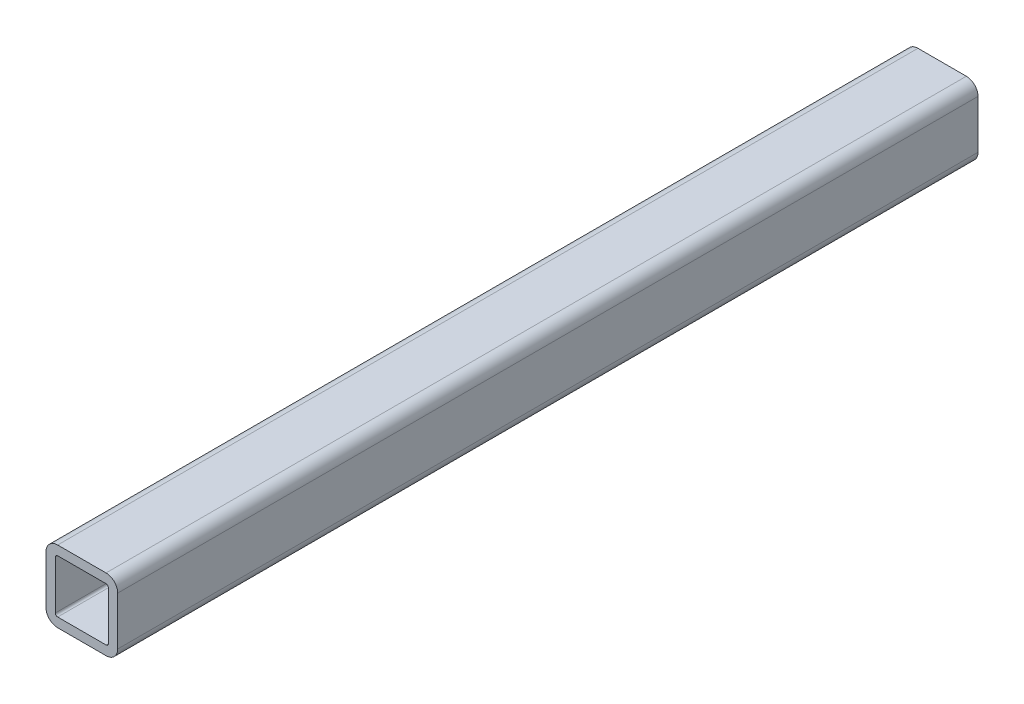
ISO-10303-21;
HEADER;
FILE_DESCRIPTION(('STEP AP214'),'2;1');
FILE_NAME('part.step','',(''),(''),'','','');
FILE_SCHEMA(('AUTOMOTIVE_DESIGN { 1 0 10303 214 1 1 1 1 }'));
ENDSEC;
DATA;
#1=APPLICATION_CONTEXT('core data for automotive mechanical design processes');
#2=APPLICATION_PROTOCOL_DEFINITION('international standard','automotive_design',2000,#1);
#3=PRODUCT_CONTEXT('',#1,'mechanical');
#4=PRODUCT('Part','Part','',(#3));
#5=PRODUCT_RELATED_PRODUCT_CATEGORY('part','',(#4));
#6=PRODUCT_DEFINITION_FORMATION('','',#4);
#7=PRODUCT_DEFINITION_CONTEXT('part definition',#1,'design');
#8=PRODUCT_DEFINITION('design','',#6,#7);
#9=PRODUCT_DEFINITION_SHAPE('','',#8);
#10=(LENGTH_UNIT() NAMED_UNIT(*) SI_UNIT(.MILLI.,.METRE.));
#11=(NAMED_UNIT(*) PLANE_ANGLE_UNIT() SI_UNIT($,.RADIAN.));
#12=(NAMED_UNIT(*) SI_UNIT($,.STERADIAN.) SOLID_ANGLE_UNIT());
#13=UNCERTAINTY_MEASURE_WITH_UNIT(LENGTH_MEASURE(1.E-05),#10,'distance_accuracy_value','');
#14=(GEOMETRIC_REPRESENTATION_CONTEXT(3) GLOBAL_UNCERTAINTY_ASSIGNED_CONTEXT((#13)) GLOBAL_UNIT_ASSIGNED_CONTEXT((#10,
#11,#12)) REPRESENTATION_CONTEXT('',''));
#15=CARTESIAN_POINT('',(0.,0.,0.));
#16=DIRECTION('',(0.,0.,1.));
#17=DIRECTION('',(1.,0.,0.));
#18=AXIS2_PLACEMENT_3D('',#15,#16,#17);
#19=CARTESIAN_POINT('',(4.28625000000001,-4.28625000000001,76.2));
#20=DIRECTION('',(0.,0.,1.));
#21=DIRECTION('',(1.,0.,0.));
#22=AXIS2_PLACEMENT_3D('',#19,#20,#21);
#23=PLANE('',#22);
#24=CARTESIAN_POINT('',(4.28625000000001,-4.28625000000001,76.2));
#25=DIRECTION('',(0.,0.,1.));
#26=DIRECTION('',(1.,0.,0.));
#27=AXIS2_PLACEMENT_3D('',#24,#25,#26);
#28=CIRCLE('',#27,2.06375);
#29=CARTESIAN_POINT('',(4.28625000000001,-6.35000000000001,76.2));
#30=VERTEX_POINT('',#29);
#31=CARTESIAN_POINT('',(6.35000000000001,-4.28625000000001,76.2));
#32=VERTEX_POINT('',#31);
#33=EDGE_CURVE('E247',#30,#32,#28,.T.);
#34=ORIENTED_EDGE('',*,*,#33,.T.);
#35=DIRECTION('',(0.,1.,0.));
#36=VECTOR('',#35,1.);
#37=CARTESIAN_POINT('',(6.35000000000001,-4.28625000000001,76.2));
#38=LINE('',#37,#36);
#39=CARTESIAN_POINT('',(6.35000000000001,4.28625000000001,76.2));
#40=VERTEX_POINT('',#39);
#41=EDGE_CURVE('E251',#32,#40,#38,.T.);
#42=ORIENTED_EDGE('',*,*,#41,.T.);
#43=CARTESIAN_POINT('',(4.28625000000001,4.28625000000001,76.2));
#44=DIRECTION('',(0.,0.,1.));
#45=DIRECTION('',(1.,0.,0.));
#46=AXIS2_PLACEMENT_3D('',#43,#44,#45);
#47=CIRCLE('',#46,2.06375);
#48=CARTESIAN_POINT('',(4.28625000000001,6.35000000000001,76.2));
#49=VERTEX_POINT('',#48);
#50=EDGE_CURVE('E255',#40,#49,#47,.T.);
#51=ORIENTED_EDGE('',*,*,#50,.T.);
#52=DIRECTION('',(-1.,0.,0.));
#53=VECTOR('',#52,1.);
#54=CARTESIAN_POINT('',(4.28625000000001,6.35000000000001,76.2));
#55=LINE('',#54,#53);
#56=CARTESIAN_POINT('',(-4.28625000000001,6.35000000000001,76.2));
#57=VERTEX_POINT('',#56);
#58=EDGE_CURVE('E258',#49,#57,#55,.T.);
#59=ORIENTED_EDGE('',*,*,#58,.T.);
#60=CARTESIAN_POINT('',(-4.28625000000001,4.28625000000001,76.2));
#61=DIRECTION('',(0.,0.,1.));
#62=DIRECTION('',(1.,0.,0.));
#63=AXIS2_PLACEMENT_3D('',#60,#61,#62);
#64=CIRCLE('',#63,2.06375);
#65=CARTESIAN_POINT('',(-6.35000000000001,4.28625000000001,76.2));
#66=VERTEX_POINT('',#65);
#67=EDGE_CURVE('E261',#57,#66,#64,.T.);
#68=ORIENTED_EDGE('',*,*,#67,.T.);
#69=DIRECTION('',(0.,-1.,0.));
#70=VECTOR('',#69,1.);
#71=CARTESIAN_POINT('',(-6.35000000000001,-4.28625000000001,76.2));
#72=LINE('',#71,#70);
#73=CARTESIAN_POINT('',(-6.35000000000001,-4.28625000000001,76.2));
#74=VERTEX_POINT('',#73);
#75=EDGE_CURVE('E264',#66,#74,#72,.T.);
#76=ORIENTED_EDGE('',*,*,#75,.T.);
#77=CARTESIAN_POINT('',(-4.28625000000001,-4.28625000000001,76.2));
#78=DIRECTION('',(0.,0.,1.));
#79=DIRECTION('',(1.,0.,0.));
#80=AXIS2_PLACEMENT_3D('',#77,#78,#79);
#81=CIRCLE('',#80,2.06375);
#82=CARTESIAN_POINT('',(-4.28625000000001,-6.35000000000001,76.2));
#83=VERTEX_POINT('',#82);
#84=EDGE_CURVE('E267',#74,#83,#81,.T.);
#85=ORIENTED_EDGE('',*,*,#84,.T.);
#86=DIRECTION('',(1.,0.,0.));
#87=VECTOR('',#86,1.);
#88=CARTESIAN_POINT('',(4.28625000000001,-6.35000000000001,76.2));
#89=LINE('',#88,#87);
#90=EDGE_CURVE('E270',#83,#30,#89,.T.);
#91=ORIENTED_EDGE('',*,*,#90,.T.);
#92=EDGE_LOOP('',(#34,#42,#51,#59,#68,#76,#85,#91));
#93=FACE_BOUND('',#92,.T.);
#94=DIRECTION('',(-1.,0.,0.));
#95=VECTOR('',#94,1.);
#96=CARTESIAN_POINT('',(4.28625000000001,4.69900000000001,76.2));
#97=LINE('',#96,#95);
#98=CARTESIAN_POINT('',(4.28625000000001,4.69900000000001,76.2));
#99=VERTEX_POINT('',#98);
#100=CARTESIAN_POINT('',(-4.28625000000001,4.69900000000001,76.2));
#101=VERTEX_POINT('',#100);
#102=EDGE_CURVE('E167',#99,#101,#97,.T.);
#103=ORIENTED_EDGE('',*,*,#102,.F.);
#104=CARTESIAN_POINT('',(4.28625000000001,4.28625000000001,76.2));
#105=DIRECTION('',(0.,0.,1.));
#106=DIRECTION('',(1.,0.,0.));
#107=AXIS2_PLACEMENT_3D('',#104,#105,#106);
#108=CIRCLE('',#107,0.412750000000003);
#109=CARTESIAN_POINT('',(4.69900000000001,4.28625000000001,76.2));
#110=VERTEX_POINT('',#109);
#111=EDGE_CURVE('E158',#110,#99,#108,.T.);
#112=ORIENTED_EDGE('',*,*,#111,.F.);
#113=DIRECTION('',(0.,1.,0.));
#114=VECTOR('',#113,1.);
#115=CARTESIAN_POINT('',(4.69900000000001,4.28625000000001,76.2));
#116=LINE('',#115,#114);
#117=CARTESIAN_POINT('',(4.69900000000001,-4.28625000000001,76.2));
#118=VERTEX_POINT('',#117);
#119=EDGE_CURVE('E199',#118,#110,#116,.T.);
#120=ORIENTED_EDGE('',*,*,#119,.F.);
#121=CARTESIAN_POINT('',(4.28625000000001,-4.28625000000001,76.2));
#122=DIRECTION('',(0.,0.,1.));
#123=DIRECTION('',(1.,0.,0.));
#124=AXIS2_PLACEMENT_3D('',#121,#122,#123);
#125=CIRCLE('',#124,0.412750000000003);
#126=CARTESIAN_POINT('',(4.28625000000001,-4.69900000000001,76.2));
#127=VERTEX_POINT('',#126);
#128=EDGE_CURVE('E196',#127,#118,#125,.T.);
#129=ORIENTED_EDGE('',*,*,#128,.F.);
#130=DIRECTION('',(1.,0.,0.));
#131=VECTOR('',#130,1.);
#132=CARTESIAN_POINT('',(4.28625000000001,-4.69900000000001,76.2));
#133=LINE('',#132,#131);
#134=CARTESIAN_POINT('',(-4.28625000000001,-4.69900000000001,76.2));
#135=VERTEX_POINT('',#134);
#136=EDGE_CURVE('E193',#135,#127,#133,.T.);
#137=ORIENTED_EDGE('',*,*,#136,.F.);
#138=CARTESIAN_POINT('',(-4.28625000000001,-4.28625000000001,76.2));
#139=DIRECTION('',(0.,0.,1.));
#140=DIRECTION('',(1.,0.,0.));
#141=AXIS2_PLACEMENT_3D('',#138,#139,#140);
#142=CIRCLE('',#141,0.412750000000003);
#143=CARTESIAN_POINT('',(-4.69900000000001,-4.28625000000001,76.2));
#144=VERTEX_POINT('',#143);
#145=EDGE_CURVE('E190',#144,#135,#142,.T.);
#146=ORIENTED_EDGE('',*,*,#145,.F.);
#147=DIRECTION('',(0.,-1.,0.));
#148=VECTOR('',#147,1.);
#149=CARTESIAN_POINT('',(-4.69900000000001,4.28625000000001,76.2));
#150=LINE('',#149,#148);
#151=CARTESIAN_POINT('',(-4.69900000000001,4.28625000000001,76.2));
#152=VERTEX_POINT('',#151);
#153=EDGE_CURVE('E185',#152,#144,#150,.T.);
#154=ORIENTED_EDGE('',*,*,#153,.F.);
#155=CARTESIAN_POINT('',(-4.28625000000001,4.28625000000001,76.2));
#156=DIRECTION('',(0.,0.,1.));
#157=DIRECTION('',(1.,0.,0.));
#158=AXIS2_PLACEMENT_3D('',#155,#156,#157);
#159=CIRCLE('',#158,0.412750000000003);
#160=EDGE_CURVE('E181',#101,#152,#159,.T.);
#161=ORIENTED_EDGE('',*,*,#160,.F.);
#162=EDGE_LOOP('',(#103,#112,#120,#129,#137,#146,#154,#161));
#163=FACE_BOUND('',#162,.T.);
#164=ADVANCED_FACE('F44',(#93,#163),#23,.T.);
#165=CARTESIAN_POINT('',(4.28625000000001,-4.28625000000001,-76.2));
#166=DIRECTION('',(0.,0.,1.));
#167=DIRECTION('',(1.,0.,0.));
#168=AXIS2_PLACEMENT_3D('',#165,#166,#167);
#169=PLANE('',#168);
#170=CARTESIAN_POINT('',(4.28625000000001,-4.28625000000001,-76.2));
#171=DIRECTION('',(0.,0.,1.));
#172=DIRECTION('',(1.,0.,0.));
#173=AXIS2_PLACEMENT_3D('',#170,#171,#172);
#174=CIRCLE('',#173,2.06375);
#175=CARTESIAN_POINT('',(4.28625000000001,-6.35000000000001,-76.2));
#176=VERTEX_POINT('',#175);
#177=CARTESIAN_POINT('',(6.35000000000001,-4.28625000000001,-76.2));
#178=VERTEX_POINT('',#177);
#179=EDGE_CURVE('E176',#176,#178,#174,.T.);
#180=ORIENTED_EDGE('',*,*,#179,.F.);
#181=DIRECTION('',(1.,0.,0.));
#182=VECTOR('',#181,1.);
#183=CARTESIAN_POINT('',(4.28625000000001,-6.35000000000001,-76.2));
#184=LINE('',#183,#182);
#185=CARTESIAN_POINT('',(-4.28625000000001,-6.35000000000001,-76.2));
#186=VERTEX_POINT('',#185);
#187=EDGE_CURVE('E252',#186,#176,#184,.T.);
#188=ORIENTED_EDGE('',*,*,#187,.F.);
#189=CARTESIAN_POINT('',(-4.28625000000001,-4.28625000000001,-76.2));
#190=DIRECTION('',(0.,0.,1.));
#191=DIRECTION('',(1.,0.,0.));
#192=AXIS2_PLACEMENT_3D('',#189,#190,#191);
#193=CIRCLE('',#192,2.06375);
#194=CARTESIAN_POINT('',(-6.35000000000001,-4.28625000000001,-76.2));
#195=VERTEX_POINT('',#194);
#196=EDGE_CURVE('E292',#195,#186,#193,.T.);
#197=ORIENTED_EDGE('',*,*,#196,.F.);
#198=DIRECTION('',(0.,-1.,0.));
#199=VECTOR('',#198,1.);
#200=CARTESIAN_POINT('',(-6.35000000000001,-4.28625000000001,-76.2));
#201=LINE('',#200,#199);
#202=CARTESIAN_POINT('',(-6.35000000000001,4.28625000000001,-76.2));
#203=VERTEX_POINT('',#202);
#204=EDGE_CURVE('E289',#203,#195,#201,.T.);
#205=ORIENTED_EDGE('',*,*,#204,.F.);
#206=CARTESIAN_POINT('',(-4.28625000000001,4.28625000000001,-76.2));
#207=DIRECTION('',(0.,0.,1.));
#208=DIRECTION('',(1.,0.,0.));
#209=AXIS2_PLACEMENT_3D('',#206,#207,#208);
#210=CIRCLE('',#209,2.06375);
#211=CARTESIAN_POINT('',(-4.28625000000001,6.35000000000001,-76.2));
#212=VERTEX_POINT('',#211);
#213=EDGE_CURVE('E286',#212,#203,#210,.T.);
#214=ORIENTED_EDGE('',*,*,#213,.F.);
#215=DIRECTION('',(-1.,0.,0.));
#216=VECTOR('',#215,1.);
#217=CARTESIAN_POINT('',(4.28625000000001,6.35000000000001,-76.2));
#218=LINE('',#217,#216);
#219=CARTESIAN_POINT('',(4.28625000000001,6.35000000000001,-76.2));
#220=VERTEX_POINT('',#219);
#221=EDGE_CURVE('E283',#220,#212,#218,.T.);
#222=ORIENTED_EDGE('',*,*,#221,.F.);
#223=CARTESIAN_POINT('',(4.28625000000001,4.28625000000001,-76.2));
#224=DIRECTION('',(0.,0.,1.));
#225=DIRECTION('',(1.,0.,0.));
#226=AXIS2_PLACEMENT_3D('',#223,#224,#225);
#227=CIRCLE('',#226,2.06375);
#228=CARTESIAN_POINT('',(6.35000000000001,4.28625000000001,-76.2));
#229=VERTEX_POINT('',#228);
#230=EDGE_CURVE('E280',#229,#220,#227,.T.);
#231=ORIENTED_EDGE('',*,*,#230,.F.);
#232=DIRECTION('',(0.,1.,0.));
#233=VECTOR('',#232,1.);
#234=CARTESIAN_POINT('',(6.35000000000001,-4.28625000000001,-76.2));
#235=LINE('',#234,#233);
#236=EDGE_CURVE('E277',#178,#229,#235,.T.);
#237=ORIENTED_EDGE('',*,*,#236,.F.);
#238=EDGE_LOOP('',(#180,#188,#197,#205,#214,#222,#231,#237));
#239=FACE_BOUND('',#238,.T.);
#240=CARTESIAN_POINT('',(4.28625000000001,4.28625000000001,-76.2));
#241=DIRECTION('',(0.,0.,1.));
#242=DIRECTION('',(1.,0.,0.));
#243=AXIS2_PLACEMENT_3D('',#240,#241,#242);
#244=CIRCLE('',#243,0.412750000000003);
#245=CARTESIAN_POINT('',(4.69900000000001,4.28625000000001,-76.2));
#246=VERTEX_POINT('',#245);
#247=CARTESIAN_POINT('',(4.28625000000001,4.69900000000001,-76.2));
#248=VERTEX_POINT('',#247);
#249=EDGE_CURVE('E68',#246,#248,#244,.T.);
#250=ORIENTED_EDGE('',*,*,#249,.T.);
#251=DIRECTION('',(-1.,0.,0.));
#252=VECTOR('',#251,1.);
#253=CARTESIAN_POINT('',(4.28625000000001,4.69900000000001,-76.2));
#254=LINE('',#253,#252);
#255=CARTESIAN_POINT('',(-4.28625000000001,4.69900000000001,-76.2));
#256=VERTEX_POINT('',#255);
#257=EDGE_CURVE('E174',#248,#256,#254,.T.);
#258=ORIENTED_EDGE('',*,*,#257,.T.);
#259=CARTESIAN_POINT('',(-4.28625000000001,4.28625000000001,-76.2));
#260=DIRECTION('',(0.,0.,1.));
#261=DIRECTION('',(1.,0.,0.));
#262=AXIS2_PLACEMENT_3D('',#259,#260,#261);
#263=CIRCLE('',#262,0.412750000000003);
#264=CARTESIAN_POINT('',(-4.69900000000001,4.28625000000001,-76.2));
#265=VERTEX_POINT('',#264);
#266=EDGE_CURVE('E206',#256,#265,#263,.T.);
#267=ORIENTED_EDGE('',*,*,#266,.T.);
#268=DIRECTION('',(0.,-1.,0.));
#269=VECTOR('',#268,1.);
#270=CARTESIAN_POINT('',(-4.69900000000001,4.28625000000001,-76.2));
#271=LINE('',#270,#269);
#272=CARTESIAN_POINT('',(-4.69900000000001,-4.28625000000001,-76.2));
#273=VERTEX_POINT('',#272);
#274=EDGE_CURVE('E210',#265,#273,#271,.T.);
#275=ORIENTED_EDGE('',*,*,#274,.T.);
#276=CARTESIAN_POINT('',(-4.28625000000001,-4.28625000000001,-76.2));
#277=DIRECTION('',(0.,0.,1.));
#278=DIRECTION('',(1.,0.,0.));
#279=AXIS2_PLACEMENT_3D('',#276,#277,#278);
#280=CIRCLE('',#279,0.412750000000003);
#281=CARTESIAN_POINT('',(-4.28625000000001,-4.69900000000001,-76.2));
#282=VERTEX_POINT('',#281);
#283=EDGE_CURVE('E214',#273,#282,#280,.T.);
#284=ORIENTED_EDGE('',*,*,#283,.T.);
#285=DIRECTION('',(1.,0.,0.));
#286=VECTOR('',#285,1.);
#287=CARTESIAN_POINT('',(4.28625000000001,-4.69900000000001,-76.2));
#288=LINE('',#287,#286);
#289=CARTESIAN_POINT('',(4.28625000000001,-4.69900000000001,-76.2));
#290=VERTEX_POINT('',#289);
#291=EDGE_CURVE('E218',#282,#290,#288,.T.);
#292=ORIENTED_EDGE('',*,*,#291,.T.);
#293=CARTESIAN_POINT('',(4.28625000000001,-4.28625000000001,-76.2));
#294=DIRECTION('',(0.,0.,1.));
#295=DIRECTION('',(1.,0.,0.));
#296=AXIS2_PLACEMENT_3D('',#293,#294,#295);
#297=CIRCLE('',#296,0.412750000000003);
#298=CARTESIAN_POINT('',(4.69900000000001,-4.28625000000001,-76.2));
#299=VERTEX_POINT('',#298);
#300=EDGE_CURVE('E222',#290,#299,#297,.T.);
#301=ORIENTED_EDGE('',*,*,#300,.T.);
#302=DIRECTION('',(0.,1.,0.));
#303=VECTOR('',#302,1.);
#304=CARTESIAN_POINT('',(4.69900000000001,4.28625000000001,-76.2));
#305=LINE('',#304,#303);
#306=EDGE_CURVE('E168',#299,#246,#305,.T.);
#307=ORIENTED_EDGE('',*,*,#306,.T.);
#308=EDGE_LOOP('',(#250,#258,#267,#275,#284,#292,#301,#307));
#309=FACE_BOUND('',#308,.T.);
#310=ADVANCED_FACE('F331',(#239,#309),#169,.F.);
#311=CARTESIAN_POINT('',(4.28625000000001,-4.28625000000001,76.2));
#312=DIRECTION('',(0.,0.,-1.));
#313=DIRECTION('',(-1.,0.,0.));
#314=AXIS2_PLACEMENT_3D('',#311,#312,#313);
#315=CYLINDRICAL_SURFACE('',#314,2.06375);
#316=ORIENTED_EDGE('',*,*,#179,.T.);
#317=DIRECTION('',(0.,0.,-1.));
#318=VECTOR('',#317,1.);
#319=CARTESIAN_POINT('',(6.35000000000001,-4.28625000000001,76.2));
#320=LINE('',#319,#318);
#321=EDGE_CURVE('E11',#32,#178,#320,.T.);
#322=ORIENTED_EDGE('',*,*,#321,.F.);
#323=ORIENTED_EDGE('',*,*,#33,.F.);
#324=DIRECTION('',(0.,0.,-1.));
#325=VECTOR('',#324,1.);
#326=CARTESIAN_POINT('',(4.28625000000001,-6.35000000000001,76.2));
#327=LINE('',#326,#325);
#328=EDGE_CURVE('E273',#30,#176,#327,.T.);
#329=ORIENTED_EDGE('',*,*,#328,.T.);
#330=EDGE_LOOP('',(#316,#322,#323,#329));
#331=FACE_BOUND('',#330,.T.);
#332=ADVANCED_FACE('F46',(#331),#315,.T.);
#333=CARTESIAN_POINT('',(6.35000000000001,-4.28625000000001,76.2));
#334=DIRECTION('',(-1.,0.,0.));
#335=DIRECTION('',(0.,0.,1.));
#336=AXIS2_PLACEMENT_3D('',#333,#334,#335);
#337=PLANE('',#336);
#338=ORIENTED_EDGE('',*,*,#236,.T.);
#339=DIRECTION('',(0.,0.,-1.));
#340=VECTOR('',#339,1.);
#341=CARTESIAN_POINT('',(6.35000000000001,4.28625000000001,76.2));
#342=LINE('',#341,#340);
#343=EDGE_CURVE('E53',#40,#229,#342,.T.);
#344=ORIENTED_EDGE('',*,*,#343,.F.);
#345=ORIENTED_EDGE('',*,*,#41,.F.);
#346=ORIENTED_EDGE('',*,*,#321,.T.);
#347=EDGE_LOOP('',(#338,#344,#345,#346));
#348=FACE_BOUND('',#347,.T.);
#349=ADVANCED_FACE('F348',(#348),#337,.F.);
#350=CARTESIAN_POINT('',(4.28625000000001,4.28625000000001,76.2));
#351=DIRECTION('',(0.,0.,-1.));
#352=DIRECTION('',(-1.,0.,0.));
#353=AXIS2_PLACEMENT_3D('',#350,#351,#352);
#354=CYLINDRICAL_SURFACE('',#353,2.06375);
#355=ORIENTED_EDGE('',*,*,#230,.T.);
#356=DIRECTION('',(0.,0.,-1.));
#357=VECTOR('',#356,1.);
#358=CARTESIAN_POINT('',(4.28625000000001,6.35000000000001,76.2));
#359=LINE('',#358,#357);
#360=EDGE_CURVE('E316',#49,#220,#359,.T.);
#361=ORIENTED_EDGE('',*,*,#360,.F.);
#362=ORIENTED_EDGE('',*,*,#50,.F.);
#363=ORIENTED_EDGE('',*,*,#343,.T.);
#364=EDGE_LOOP('',(#355,#361,#362,#363));
#365=FACE_BOUND('',#364,.T.);
#366=ADVANCED_FACE('F325',(#365),#354,.T.);
#367=CARTESIAN_POINT('',(4.28625000000001,6.35000000000001,76.2));
#368=DIRECTION('',(0.,-1.,0.));
#369=DIRECTION('',(0.,0.,-1.));
#370=AXIS2_PLACEMENT_3D('',#367,#368,#369);
#371=PLANE('',#370);
#372=ORIENTED_EDGE('',*,*,#221,.T.);
#373=DIRECTION('',(0.,0.,-1.));
#374=VECTOR('',#373,1.);
#375=CARTESIAN_POINT('',(-4.28625000000001,6.35000000000001,76.2));
#376=LINE('',#375,#374);
#377=EDGE_CURVE('E312',#57,#212,#376,.T.);
#378=ORIENTED_EDGE('',*,*,#377,.F.);
#379=ORIENTED_EDGE('',*,*,#58,.F.);
#380=ORIENTED_EDGE('',*,*,#360,.T.);
#381=EDGE_LOOP('',(#372,#378,#379,#380));
#382=FACE_BOUND('',#381,.T.);
#383=ADVANCED_FACE('F337',(#382),#371,.F.);
#384=CARTESIAN_POINT('',(-4.28625000000001,4.28625000000001,76.2));
#385=DIRECTION('',(0.,0.,-1.));
#386=DIRECTION('',(-1.,0.,0.));
#387=AXIS2_PLACEMENT_3D('',#384,#385,#386);
#388=CYLINDRICAL_SURFACE('',#387,2.06375);
#389=ORIENTED_EDGE('',*,*,#213,.T.);
#390=DIRECTION('',(0.,0.,-1.));
#391=VECTOR('',#390,1.);
#392=CARTESIAN_POINT('',(-6.35000000000001,4.28625000000001,76.2));
#393=LINE('',#392,#391);
#394=EDGE_CURVE('E308',#66,#203,#393,.T.);
#395=ORIENTED_EDGE('',*,*,#394,.F.);
#396=ORIENTED_EDGE('',*,*,#67,.F.);
#397=ORIENTED_EDGE('',*,*,#377,.T.);
#398=EDGE_LOOP('',(#389,#395,#396,#397));
#399=FACE_BOUND('',#398,.T.);
#400=ADVANCED_FACE('F341',(#399),#388,.T.);
#401=CARTESIAN_POINT('',(-6.35000000000001,-4.28625000000001,76.2));
#402=DIRECTION('',(1.,0.,0.));
#403=DIRECTION('',(0.,0.,-1.));
#404=AXIS2_PLACEMENT_3D('',#401,#402,#403);
#405=PLANE('',#404);
#406=ORIENTED_EDGE('',*,*,#204,.T.);
#407=DIRECTION('',(0.,0.,-1.));
#408=VECTOR('',#407,1.);
#409=CARTESIAN_POINT('',(-6.35000000000001,-4.28625000000001,76.2));
#410=LINE('',#409,#408);
#411=EDGE_CURVE('E304',#74,#195,#410,.T.);
#412=ORIENTED_EDGE('',*,*,#411,.F.);
#413=ORIENTED_EDGE('',*,*,#75,.F.);
#414=ORIENTED_EDGE('',*,*,#394,.T.);
#415=EDGE_LOOP('',(#406,#412,#413,#414));
#416=FACE_BOUND('',#415,.T.);
#417=ADVANCED_FACE('F361',(#416),#405,.F.);
#418=CARTESIAN_POINT('',(-4.28625000000001,-4.28625000000001,76.2));
#419=DIRECTION('',(0.,0.,-1.));
#420=DIRECTION('',(-1.,0.,0.));
#421=AXIS2_PLACEMENT_3D('',#418,#419,#420);
#422=CYLINDRICAL_SURFACE('',#421,2.06375);
#423=ORIENTED_EDGE('',*,*,#196,.T.);
#424=DIRECTION('',(0.,0.,-1.));
#425=VECTOR('',#424,1.);
#426=CARTESIAN_POINT('',(-4.28625000000001,-6.35000000000001,76.2));
#427=LINE('',#426,#425);
#428=EDGE_CURVE('E300',#83,#186,#427,.T.);
#429=ORIENTED_EDGE('',*,*,#428,.F.);
#430=ORIENTED_EDGE('',*,*,#84,.F.);
#431=ORIENTED_EDGE('',*,*,#411,.T.);
#432=EDGE_LOOP('',(#423,#429,#430,#431));
#433=FACE_BOUND('',#432,.T.);
#434=ADVANCED_FACE('F359',(#433),#422,.T.);
#435=CARTESIAN_POINT('',(4.28625000000001,-6.35000000000001,76.2));
#436=DIRECTION('',(0.,1.,0.));
#437=DIRECTION('',(0.,0.,1.));
#438=AXIS2_PLACEMENT_3D('',#435,#436,#437);
#439=PLANE('',#438);
#440=ORIENTED_EDGE('',*,*,#187,.T.);
#441=ORIENTED_EDGE('',*,*,#328,.F.);
#442=ORIENTED_EDGE('',*,*,#90,.F.);
#443=ORIENTED_EDGE('',*,*,#428,.T.);
#444=EDGE_LOOP('',(#440,#441,#442,#443));
#445=FACE_BOUND('',#444,.T.);
#446=ADVANCED_FACE('F354',(#445),#439,.F.);
#447=CARTESIAN_POINT('',(4.28625000000001,4.28625000000001,76.2));
#448=DIRECTION('',(0.,0.,-1.));
#449=DIRECTION('',(-1.,0.,0.));
#450=AXIS2_PLACEMENT_3D('',#447,#448,#449);
#451=CYLINDRICAL_SURFACE('',#450,0.412750000000003);
#452=ORIENTED_EDGE('',*,*,#249,.F.);
#453=DIRECTION('',(0.,0.,-1.));
#454=VECTOR('',#453,1.);
#455=CARTESIAN_POINT('',(4.69900000000001,4.28625000000001,76.2));
#456=LINE('',#455,#454);
#457=EDGE_CURVE('E162',#110,#246,#456,.T.);
#458=ORIENTED_EDGE('',*,*,#457,.F.);
#459=ORIENTED_EDGE('',*,*,#111,.T.);
#460=DIRECTION('',(0.,0.,-1.));
#461=VECTOR('',#460,1.);
#462=CARTESIAN_POINT('',(4.28625000000001,4.69900000000001,76.2));
#463=LINE('',#462,#461);
#464=EDGE_CURVE('E161',#99,#248,#463,.T.);
#465=ORIENTED_EDGE('',*,*,#464,.T.);
#466=EDGE_LOOP('',(#452,#458,#459,#465));
#467=FACE_BOUND('',#466,.T.);
#468=ADVANCED_FACE('F160',(#467),#451,.F.);
#469=CARTESIAN_POINT('',(4.28625000000001,4.69900000000001,76.2));
#470=DIRECTION('',(0.,-1.,0.));
#471=DIRECTION('',(0.,0.,-1.));
#472=AXIS2_PLACEMENT_3D('',#469,#470,#471);
#473=PLANE('',#472);
#474=ORIENTED_EDGE('',*,*,#257,.F.);
#475=ORIENTED_EDGE('',*,*,#464,.F.);
#476=ORIENTED_EDGE('',*,*,#102,.T.);
#477=DIRECTION('',(0.,0.,-1.));
#478=VECTOR('',#477,1.);
#479=CARTESIAN_POINT('',(-4.28625000000001,4.69900000000001,76.2));
#480=LINE('',#479,#478);
#481=EDGE_CURVE('E177',#101,#256,#480,.T.);
#482=ORIENTED_EDGE('',*,*,#481,.T.);
#483=EDGE_LOOP('',(#474,#475,#476,#482));
#484=FACE_BOUND('',#483,.T.);
#485=ADVANCED_FACE('F171',(#484),#473,.T.);
#486=CARTESIAN_POINT('',(-4.28625000000001,4.28625000000001,76.2));
#487=DIRECTION('',(0.,0.,-1.));
#488=DIRECTION('',(-1.,0.,0.));
#489=AXIS2_PLACEMENT_3D('',#486,#487,#488);
#490=CYLINDRICAL_SURFACE('',#489,0.412750000000003);
#491=ORIENTED_EDGE('',*,*,#266,.F.);
#492=ORIENTED_EDGE('',*,*,#481,.F.);
#493=ORIENTED_EDGE('',*,*,#160,.T.);
#494=DIRECTION('',(0.,0.,-1.));
#495=VECTOR('',#494,1.);
#496=CARTESIAN_POINT('',(-4.69900000000001,4.28625000000001,76.2));
#497=LINE('',#496,#495);
#498=EDGE_CURVE('E242',#152,#265,#497,.T.);
#499=ORIENTED_EDGE('',*,*,#498,.T.);
#500=EDGE_LOOP('',(#491,#492,#493,#499));
#501=FACE_BOUND('',#500,.T.);
#502=ADVANCED_FACE('F386',(#501),#490,.F.);
#503=CARTESIAN_POINT('',(-4.69900000000001,4.28625000000001,76.2));
#504=DIRECTION('',(1.,0.,0.));
#505=DIRECTION('',(0.,0.,-1.));
#506=AXIS2_PLACEMENT_3D('',#503,#504,#505);
#507=PLANE('',#506);
#508=ORIENTED_EDGE('',*,*,#274,.F.);
#509=ORIENTED_EDGE('',*,*,#498,.F.);
#510=ORIENTED_EDGE('',*,*,#153,.T.);
#511=DIRECTION('',(0.,0.,-1.));
#512=VECTOR('',#511,1.);
#513=CARTESIAN_POINT('',(-4.69900000000001,-4.28625000000001,76.2));
#514=LINE('',#513,#512);
#515=EDGE_CURVE('E239',#144,#273,#514,.T.);
#516=ORIENTED_EDGE('',*,*,#515,.T.);
#517=EDGE_LOOP('',(#508,#509,#510,#516));
#518=FACE_BOUND('',#517,.T.);
#519=ADVANCED_FACE('F390',(#518),#507,.T.);
#520=CARTESIAN_POINT('',(-4.28625000000001,-4.28625000000001,76.2));
#521=DIRECTION('',(0.,0.,-1.));
#522=DIRECTION('',(-1.,0.,0.));
#523=AXIS2_PLACEMENT_3D('',#520,#521,#522);
#524=CYLINDRICAL_SURFACE('',#523,0.412750000000003);
#525=ORIENTED_EDGE('',*,*,#283,.F.);
#526=ORIENTED_EDGE('',*,*,#515,.F.);
#527=ORIENTED_EDGE('',*,*,#145,.T.);
#528=DIRECTION('',(0.,0.,-1.));
#529=VECTOR('',#528,1.);
#530=CARTESIAN_POINT('',(-4.28625000000001,-4.69900000000001,76.2));
#531=LINE('',#530,#529);
#532=EDGE_CURVE('E236',#135,#282,#531,.T.);
#533=ORIENTED_EDGE('',*,*,#532,.T.);
#534=EDGE_LOOP('',(#525,#526,#527,#533));
#535=FACE_BOUND('',#534,.T.);
#536=ADVANCED_FACE('F396',(#535),#524,.F.);
#537=CARTESIAN_POINT('',(4.28625000000001,-4.69900000000001,76.2));
#538=DIRECTION('',(0.,1.,0.));
#539=DIRECTION('',(0.,0.,1.));
#540=AXIS2_PLACEMENT_3D('',#537,#538,#539);
#541=PLANE('',#540);
#542=ORIENTED_EDGE('',*,*,#291,.F.);
#543=ORIENTED_EDGE('',*,*,#532,.F.);
#544=ORIENTED_EDGE('',*,*,#136,.T.);
#545=DIRECTION('',(0.,0.,-1.));
#546=VECTOR('',#545,1.);
#547=CARTESIAN_POINT('',(4.28625000000001,-4.69900000000001,76.2));
#548=LINE('',#547,#546);
#549=EDGE_CURVE('E233',#127,#290,#548,.T.);
#550=ORIENTED_EDGE('',*,*,#549,.T.);
#551=EDGE_LOOP('',(#542,#543,#544,#550));
#552=FACE_BOUND('',#551,.T.);
#553=ADVANCED_FACE('F400',(#552),#541,.T.);
#554=CARTESIAN_POINT('',(4.28625000000001,-4.28625000000001,76.2));
#555=DIRECTION('',(0.,0.,-1.));
#556=DIRECTION('',(-1.,0.,0.));
#557=AXIS2_PLACEMENT_3D('',#554,#555,#556);
#558=CYLINDRICAL_SURFACE('',#557,0.412750000000003);
#559=ORIENTED_EDGE('',*,*,#300,.F.);
#560=ORIENTED_EDGE('',*,*,#549,.F.);
#561=ORIENTED_EDGE('',*,*,#128,.T.);
#562=DIRECTION('',(0.,0.,-1.));
#563=VECTOR('',#562,1.);
#564=CARTESIAN_POINT('',(4.69900000000001,-4.28625000000001,76.2));
#565=LINE('',#564,#563);
#566=EDGE_CURVE('E60',#118,#299,#565,.T.);
#567=ORIENTED_EDGE('',*,*,#566,.T.);
#568=EDGE_LOOP('',(#559,#560,#561,#567));
#569=FACE_BOUND('',#568,.T.);
#570=ADVANCED_FACE('F404',(#569),#558,.F.);
#571=CARTESIAN_POINT('',(4.69900000000001,4.28625000000001,76.2));
#572=DIRECTION('',(-1.,0.,0.));
#573=DIRECTION('',(0.,0.,1.));
#574=AXIS2_PLACEMENT_3D('',#571,#572,#573);
#575=PLANE('',#574);
#576=ORIENTED_EDGE('',*,*,#306,.F.);
#577=ORIENTED_EDGE('',*,*,#566,.F.);
#578=ORIENTED_EDGE('',*,*,#119,.T.);
#579=ORIENTED_EDGE('',*,*,#457,.T.);
#580=EDGE_LOOP('',(#576,#577,#578,#579));
#581=FACE_BOUND('',#580,.T.);
#582=ADVANCED_FACE('F408',(#581),#575,.T.);
#583=CLOSED_SHELL('',(#164,#310,#332,#349,#366,#383,#400,#417,#434,#446,#468,#485,#502,#519,
#536,#553,#570,#582));
#584=MANIFOLD_SOLID_BREP('B2',#583);
#585=ADVANCED_BREP_SHAPE_REPRESENTATION('',(#18,#584),#14);
#586=SHAPE_DEFINITION_REPRESENTATION(#9,#585);
ENDSEC;
END-ISO-10303-21;
